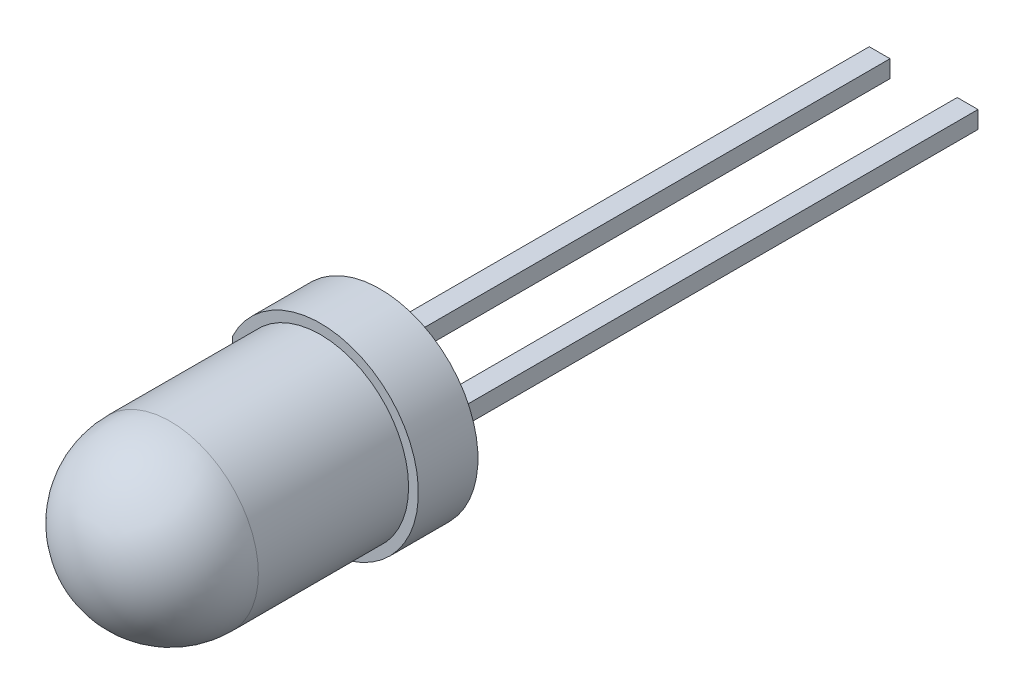
ISO-10303-21;
HEADER;
FILE_DESCRIPTION(('STEP AP214'),'2;1');
FILE_NAME('part.step','',(''),(''),'','','');
FILE_SCHEMA(('AUTOMOTIVE_DESIGN { 1 0 10303 214 1 1 1 1 }'));
ENDSEC;
DATA;
#1=APPLICATION_CONTEXT('core data for automotive mechanical design processes');
#2=APPLICATION_PROTOCOL_DEFINITION('international standard','automotive_design',2000,#1);
#3=PRODUCT_CONTEXT('',#1,'mechanical');
#4=PRODUCT('Part','Part','',(#3));
#5=PRODUCT_RELATED_PRODUCT_CATEGORY('part','',(#4));
#6=PRODUCT_DEFINITION_FORMATION('','',#4);
#7=PRODUCT_DEFINITION_CONTEXT('part definition',#1,'design');
#8=PRODUCT_DEFINITION('design','',#6,#7);
#9=PRODUCT_DEFINITION_SHAPE('','',#8);
#10=(LENGTH_UNIT() NAMED_UNIT(*) SI_UNIT(.MILLI.,.METRE.));
#11=(NAMED_UNIT(*) PLANE_ANGLE_UNIT() SI_UNIT($,.RADIAN.));
#12=(NAMED_UNIT(*) SI_UNIT($,.STERADIAN.) SOLID_ANGLE_UNIT());
#13=UNCERTAINTY_MEASURE_WITH_UNIT(LENGTH_MEASURE(1.E-05),#10,'distance_accuracy_value','');
#14=(GEOMETRIC_REPRESENTATION_CONTEXT(3) GLOBAL_UNCERTAINTY_ASSIGNED_CONTEXT((#13)) GLOBAL_UNIT_ASSIGNED_CONTEXT((#10,
#11,#12)) REPRESENTATION_CONTEXT('',''));
#15=CARTESIAN_POINT('',(0.,0.,0.));
#16=DIRECTION('',(0.,0.,1.));
#17=DIRECTION('',(1.,0.,0.));
#18=AXIS2_PLACEMENT_3D('',#15,#16,#17);
#19=CARTESIAN_POINT('',(-56.58,12.44,15.61));
#20=DIRECTION('',(0.,-1.,0.));
#21=DIRECTION('',(-1.,0.,0.));
#22=AXIS2_PLACEMENT_3D('',#19,#20,#21);
#23=PLANE('',#22);
#24=DIRECTION('',(0.,0.,-1.));
#25=VECTOR('',#24,1.);
#26=CARTESIAN_POINT('',(-56.28,12.44,15.61));
#27=LINE('',#26,#25);
#28=CARTESIAN_POINT('',(-56.28,12.44,31.57));
#29=VERTEX_POINT('',#28);
#30=CARTESIAN_POINT('',(-56.28,12.44,15.8775105573168));
#31=VERTEX_POINT('',#30);
#32=EDGE_CURVE('E11',#29,#31,#27,.T.);
#33=ORIENTED_EDGE('',*,*,#32,.T.);
#34=DIRECTION('',(1.,0.,0.));
#35=VECTOR('',#34,1.);
#36=CARTESIAN_POINT('',(-56.28,12.44,15.8775105573168));
#37=LINE('',#36,#35);
#38=CARTESIAN_POINT('',(-56.88,12.44,15.8775105573168));
#39=VERTEX_POINT('',#38);
#40=EDGE_CURVE('E153',#39,#31,#37,.T.);
#41=ORIENTED_EDGE('',*,*,#40,.F.);
#42=DIRECTION('',(0.,0.,-1.));
#43=VECTOR('',#42,1.);
#44=CARTESIAN_POINT('',(-56.88,12.44,15.61));
#45=LINE('',#44,#43);
#46=CARTESIAN_POINT('',(-56.88,12.44,31.57));
#47=VERTEX_POINT('',#46);
#48=EDGE_CURVE('E170',#47,#39,#45,.T.);
#49=ORIENTED_EDGE('',*,*,#48,.F.);
#50=DIRECTION('',(-1.,0.,0.));
#51=VECTOR('',#50,1.);
#52=CARTESIAN_POINT('',(-57.215,12.44,31.57));
#53=LINE('',#52,#51);
#54=EDGE_CURVE('E60',#29,#47,#53,.T.);
#55=ORIENTED_EDGE('',*,*,#54,.F.);
#56=EDGE_LOOP('',(#33,#41,#49,#55));
#57=FACE_BOUND('',#56,.T.);
#58=ADVANCED_FACE('F41',(#57),#23,.F.);
#59=CARTESIAN_POINT('',(-56.28,12.19,15.61));
#60=DIRECTION('',(-1.,0.,0.));
#61=DIRECTION('',(0.,-1.,0.));
#62=AXIS2_PLACEMENT_3D('',#59,#60,#61);
#63=PLANE('',#62);
#64=DIRECTION('',(0.,0.,-1.));
#65=VECTOR('',#64,1.);
#66=CARTESIAN_POINT('',(-56.28,11.94,15.61));
#67=LINE('',#66,#65);
#68=CARTESIAN_POINT('',(-56.28,11.94,31.57));
#69=VERTEX_POINT('',#68);
#70=CARTESIAN_POINT('',(-56.28,11.94,15.8775105573168));
#71=VERTEX_POINT('',#70);
#72=EDGE_CURVE('E51',#69,#71,#67,.T.);
#73=ORIENTED_EDGE('',*,*,#72,.T.);
#74=DIRECTION('',(0.,-1.,0.));
#75=VECTOR('',#74,1.);
#76=CARTESIAN_POINT('',(-56.28,12.44,15.8775105573168));
#77=LINE('',#76,#75);
#78=EDGE_CURVE('E233',#31,#71,#77,.T.);
#79=ORIENTED_EDGE('',*,*,#78,.F.);
#80=ORIENTED_EDGE('',*,*,#32,.F.);
#81=DIRECTION('',(0.,1.,0.));
#82=VECTOR('',#81,1.);
#83=CARTESIAN_POINT('',(-56.28,12.19,31.57));
#84=LINE('',#83,#82);
#85=EDGE_CURVE('E156',#69,#29,#84,.T.);
#86=ORIENTED_EDGE('',*,*,#85,.F.);
#87=EDGE_LOOP('',(#73,#79,#80,#86));
#88=FACE_BOUND('',#87,.T.);
#89=ADVANCED_FACE('F256',(#88),#63,.F.);
#90=CARTESIAN_POINT('',(-56.58,11.94,15.61));
#91=DIRECTION('',(0.,1.,0.));
#92=DIRECTION('',(0.,0.,-1.));
#93=AXIS2_PLACEMENT_3D('',#90,#91,#92);
#94=PLANE('',#93);
#95=DIRECTION('',(0.,0.,-1.));
#96=VECTOR('',#95,1.);
#97=CARTESIAN_POINT('',(-56.88,11.94,15.61));
#98=LINE('',#97,#96);
#99=CARTESIAN_POINT('',(-56.88,11.94,31.57));
#100=VERTEX_POINT('',#99);
#101=CARTESIAN_POINT('',(-56.88,11.94,15.8775105573168));
#102=VERTEX_POINT('',#101);
#103=EDGE_CURVE('E168',#100,#102,#98,.T.);
#104=ORIENTED_EDGE('',*,*,#103,.T.);
#105=DIRECTION('',(-1.,0.,0.));
#106=VECTOR('',#105,1.);
#107=CARTESIAN_POINT('',(-56.28,11.94,15.8775105573168));
#108=LINE('',#107,#106);
#109=EDGE_CURVE('E236',#71,#102,#108,.T.);
#110=ORIENTED_EDGE('',*,*,#109,.F.);
#111=ORIENTED_EDGE('',*,*,#72,.F.);
#112=DIRECTION('',(1.,0.,0.));
#113=VECTOR('',#112,1.);
#114=CARTESIAN_POINT('',(-57.215,11.94,31.57));
#115=LINE('',#114,#113);
#116=EDGE_CURVE('E158',#100,#69,#115,.T.);
#117=ORIENTED_EDGE('',*,*,#116,.F.);
#118=EDGE_LOOP('',(#104,#110,#111,#117));
#119=FACE_BOUND('',#118,.T.);
#120=ADVANCED_FACE('F245',(#119),#94,.F.);
#121=CARTESIAN_POINT('',(-56.88,12.19,15.61));
#122=DIRECTION('',(1.,0.,0.));
#123=DIRECTION('',(0.,0.,1.));
#124=AXIS2_PLACEMENT_3D('',#121,#122,#123);
#125=PLANE('',#124);
#126=ORIENTED_EDGE('',*,*,#48,.T.);
#127=DIRECTION('',(0.,1.,0.));
#128=VECTOR('',#127,1.);
#129=CARTESIAN_POINT('',(-56.88,12.44,15.8775105573168));
#130=LINE('',#129,#128);
#131=EDGE_CURVE('E238',#102,#39,#130,.T.);
#132=ORIENTED_EDGE('',*,*,#131,.F.);
#133=ORIENTED_EDGE('',*,*,#103,.F.);
#134=DIRECTION('',(0.,-1.,0.));
#135=VECTOR('',#134,1.);
#136=CARTESIAN_POINT('',(-56.88,12.19,31.57));
#137=LINE('',#136,#135);
#138=EDGE_CURVE('E163',#47,#100,#137,.T.);
#139=ORIENTED_EDGE('',*,*,#138,.F.);
#140=EDGE_LOOP('',(#126,#132,#133,#139));
#141=FACE_BOUND('',#140,.T.);
#142=ADVANCED_FACE('F246',(#141),#125,.F.);
#143=CARTESIAN_POINT('',(-59.12,12.44,15.61));
#144=DIRECTION('',(0.,-1.,0.));
#145=DIRECTION('',(-1.,0.,0.));
#146=AXIS2_PLACEMENT_3D('',#143,#144,#145);
#147=PLANE('',#146);
#148=DIRECTION('',(0.,0.,-1.));
#149=VECTOR('',#148,1.);
#150=CARTESIAN_POINT('',(-58.82,12.44,15.61));
#151=LINE('',#150,#149);
#152=CARTESIAN_POINT('',(-58.82,12.44,31.57));
#153=VERTEX_POINT('',#152);
#154=CARTESIAN_POINT('',(-58.82,12.44,15.8775105573168));
#155=VERTEX_POINT('',#154);
#156=EDGE_CURVE('E166',#153,#155,#151,.T.);
#157=ORIENTED_EDGE('',*,*,#156,.T.);
#158=DIRECTION('',(1.,0.,0.));
#159=VECTOR('',#158,1.);
#160=CARTESIAN_POINT('',(-58.82,12.44,15.8775105573168));
#161=LINE('',#160,#159);
#162=CARTESIAN_POINT('',(-59.42,12.44,15.8775105573168));
#163=VERTEX_POINT('',#162);
#164=EDGE_CURVE('E207',#163,#155,#161,.T.);
#165=ORIENTED_EDGE('',*,*,#164,.F.);
#166=DIRECTION('',(0.,0.,-1.));
#167=VECTOR('',#166,1.);
#168=CARTESIAN_POINT('',(-59.42,12.44,15.61));
#169=LINE('',#168,#167);
#170=CARTESIAN_POINT('',(-59.42,12.44,31.57));
#171=VERTEX_POINT('',#170);
#172=EDGE_CURVE('E191',#171,#163,#169,.T.);
#173=ORIENTED_EDGE('',*,*,#172,.F.);
#174=DIRECTION('',(-1.,0.,0.));
#175=VECTOR('',#174,1.);
#176=CARTESIAN_POINT('',(-58.485,12.44,31.57));
#177=LINE('',#176,#175);
#178=EDGE_CURVE('E109',#153,#171,#177,.T.);
#179=ORIENTED_EDGE('',*,*,#178,.F.);
#180=EDGE_LOOP('',(#157,#165,#173,#179));
#181=FACE_BOUND('',#180,.T.);
#182=ADVANCED_FACE('F204',(#181),#147,.F.);
#183=CARTESIAN_POINT('',(-58.82,12.19,15.61));
#184=DIRECTION('',(-1.,0.,0.));
#185=DIRECTION('',(0.,-1.,0.));
#186=AXIS2_PLACEMENT_3D('',#183,#184,#185);
#187=PLANE('',#186);
#188=DIRECTION('',(0.,0.,-1.));
#189=VECTOR('',#188,1.);
#190=CARTESIAN_POINT('',(-58.82,11.94,15.61));
#191=LINE('',#190,#189);
#192=CARTESIAN_POINT('',(-58.82,11.94,31.57));
#193=VERTEX_POINT('',#192);
#194=CARTESIAN_POINT('',(-58.82,11.94,15.8775105573168));
#195=VERTEX_POINT('',#194);
#196=EDGE_CURVE('E165',#193,#195,#191,.T.);
#197=ORIENTED_EDGE('',*,*,#196,.T.);
#198=DIRECTION('',(0.,-1.,0.));
#199=VECTOR('',#198,1.);
#200=CARTESIAN_POINT('',(-58.82,12.44,15.8775105573168));
#201=LINE('',#200,#199);
#202=EDGE_CURVE('E227',#155,#195,#201,.T.);
#203=ORIENTED_EDGE('',*,*,#202,.F.);
#204=ORIENTED_EDGE('',*,*,#156,.F.);
#205=DIRECTION('',(0.,1.,0.));
#206=VECTOR('',#205,1.);
#207=CARTESIAN_POINT('',(-58.82,12.19,31.57));
#208=LINE('',#207,#206);
#209=EDGE_CURVE('E116',#193,#153,#208,.T.);
#210=ORIENTED_EDGE('',*,*,#209,.F.);
#211=EDGE_LOOP('',(#197,#203,#204,#210));
#212=FACE_BOUND('',#211,.T.);
#213=ADVANCED_FACE('F262',(#212),#187,.F.);
#214=CARTESIAN_POINT('',(-59.12,11.94,15.61));
#215=DIRECTION('',(0.,1.,0.));
#216=DIRECTION('',(0.,0.,-1.));
#217=AXIS2_PLACEMENT_3D('',#214,#215,#216);
#218=PLANE('',#217);
#219=DIRECTION('',(0.,0.,-1.));
#220=VECTOR('',#219,1.);
#221=CARTESIAN_POINT('',(-59.42,11.94,15.61));
#222=LINE('',#221,#220);
#223=CARTESIAN_POINT('',(-59.42,11.94,31.57));
#224=VERTEX_POINT('',#223);
#225=CARTESIAN_POINT('',(-59.42,11.94,15.8775105573168));
#226=VERTEX_POINT('',#225);
#227=EDGE_CURVE('E167',#224,#226,#222,.T.);
#228=ORIENTED_EDGE('',*,*,#227,.T.);
#229=DIRECTION('',(-1.,0.,0.));
#230=VECTOR('',#229,1.);
#231=CARTESIAN_POINT('',(-58.82,11.94,15.8775105573168));
#232=LINE('',#231,#230);
#233=EDGE_CURVE('E221',#195,#226,#232,.T.);
#234=ORIENTED_EDGE('',*,*,#233,.F.);
#235=ORIENTED_EDGE('',*,*,#196,.F.);
#236=DIRECTION('',(1.,0.,0.));
#237=VECTOR('',#236,1.);
#238=CARTESIAN_POINT('',(-58.485,11.94,31.57));
#239=LINE('',#238,#237);
#240=EDGE_CURVE('E148',#224,#193,#239,.T.);
#241=ORIENTED_EDGE('',*,*,#240,.F.);
#242=EDGE_LOOP('',(#228,#234,#235,#241));
#243=FACE_BOUND('',#242,.T.);
#244=ADVANCED_FACE('F219',(#243),#218,.F.);
#245=CARTESIAN_POINT('',(-59.42,12.19,15.61));
#246=DIRECTION('',(1.,0.,0.));
#247=DIRECTION('',(0.,0.,1.));
#248=AXIS2_PLACEMENT_3D('',#245,#246,#247);
#249=PLANE('',#248);
#250=ORIENTED_EDGE('',*,*,#172,.T.);
#251=DIRECTION('',(0.,1.,0.));
#252=VECTOR('',#251,1.);
#253=CARTESIAN_POINT('',(-59.42,12.44,15.8775105573168));
#254=LINE('',#253,#252);
#255=EDGE_CURVE('E215',#226,#163,#254,.T.);
#256=ORIENTED_EDGE('',*,*,#255,.F.);
#257=ORIENTED_EDGE('',*,*,#227,.F.);
#258=DIRECTION('',(0.,-1.,0.));
#259=VECTOR('',#258,1.);
#260=CARTESIAN_POINT('',(-59.42,12.19,31.57));
#261=LINE('',#260,#259);
#262=EDGE_CURVE('E195',#171,#224,#261,.T.);
#263=ORIENTED_EDGE('',*,*,#262,.F.);
#264=EDGE_LOOP('',(#250,#256,#257,#263));
#265=FACE_BOUND('',#264,.T.);
#266=ADVANCED_FACE('F213',(#265),#249,.F.);
#267=CARTESIAN_POINT('',(-60.3925,12.19,32.43));
#268=DIRECTION('',(-1.,0.,0.));
#269=DIRECTION('',(0.,-1.,0.));
#270=AXIS2_PLACEMENT_3D('',#267,#268,#269);
#271=PLANE('',#270);
#272=DIRECTION('',(0.,0.,1.));
#273=VECTOR('',#272,1.);
#274=CARTESIAN_POINT('',(-60.3925,13.4213889515502,32.43));
#275=LINE('',#274,#273);
#276=CARTESIAN_POINT('',(-60.3925,13.4213889515502,31.57));
#277=VERTEX_POINT('',#276);
#278=CARTESIAN_POINT('',(-60.3925,13.4213889515502,33.29));
#279=VERTEX_POINT('',#278);
#280=EDGE_CURVE('E136',#277,#279,#275,.T.);
#281=ORIENTED_EDGE('',*,*,#280,.F.);
#282=DIRECTION('',(0.,1.,0.));
#283=VECTOR('',#282,1.);
#284=CARTESIAN_POINT('',(-60.3925,12.19,31.57));
#285=LINE('',#284,#283);
#286=CARTESIAN_POINT('',(-60.3925,10.9586110484498,31.57));
#287=VERTEX_POINT('',#286);
#288=EDGE_CURVE('E126',#287,#277,#285,.T.);
#289=ORIENTED_EDGE('',*,*,#288,.F.);
#290=DIRECTION('',(0.,0.,-1.));
#291=VECTOR('',#290,1.);
#292=CARTESIAN_POINT('',(-60.3925,10.9586110484498,32.43));
#293=LINE('',#292,#291);
#294=CARTESIAN_POINT('',(-60.3925,10.9586110484498,33.29));
#295=VERTEX_POINT('',#294);
#296=EDGE_CURVE('E142',#295,#287,#293,.T.);
#297=ORIENTED_EDGE('',*,*,#296,.F.);
#298=DIRECTION('',(0.,-1.,0.));
#299=VECTOR('',#298,1.);
#300=CARTESIAN_POINT('',(-60.3925,12.19,33.29));
#301=LINE('',#300,#299);
#302=CARTESIAN_POINT('',(-60.3925,12.19,33.29));
#303=VERTEX_POINT('',#302);
#304=EDGE_CURVE('E161',#303,#295,#301,.T.);
#305=ORIENTED_EDGE('',*,*,#304,.F.);
#306=DIRECTION('',(0.,-1.,0.));
#307=VECTOR('',#306,1.);
#308=CARTESIAN_POINT('',(-60.3925,12.19,33.29));
#309=LINE('',#308,#307);
#310=EDGE_CURVE('E45',#279,#303,#309,.T.);
#311=ORIENTED_EDGE('',*,*,#310,.F.);
#312=EDGE_LOOP('',(#281,#289,#297,#305,#311));
#313=FACE_BOUND('',#312,.T.);
#314=ADVANCED_FACE('F137',(#313),#271,.T.);
#315=CARTESIAN_POINT('',(-57.85,12.19,33.29));
#316=DIRECTION('',(0.,0.,1.));
#317=DIRECTION('',(-1.,0.,0.));
#318=AXIS2_PLACEMENT_3D('',#315,#316,#317);
#319=PLANE('',#318);
#320=ORIENTED_EDGE('',*,*,#310,.T.);
#321=CARTESIAN_POINT('',(-57.85,12.19,33.29));
#322=DIRECTION('',(0.,0.,-1.));
#323=DIRECTION('',(-1.,0.,0.));
#324=AXIS2_PLACEMENT_3D('',#321,#322,#323);
#325=CIRCLE('',#324,2.5425);
#326=CARTESIAN_POINT('',(-55.3075,12.19,33.29));
#327=VERTEX_POINT('',#326);
#328=EDGE_CURVE('E154',#303,#327,#325,.T.);
#329=ORIENTED_EDGE('',*,*,#328,.T.);
#330=CARTESIAN_POINT('',(-57.85,12.19,33.29));
#331=DIRECTION('',(0.,0.,-1.));
#332=DIRECTION('',(-1.,0.,0.));
#333=AXIS2_PLACEMENT_3D('',#330,#331,#332);
#334=CIRCLE('',#333,2.5425);
#335=EDGE_CURVE('E91',#327,#303,#334,.T.);
#336=ORIENTED_EDGE('',*,*,#335,.T.);
#337=ORIENTED_EDGE('',*,*,#304,.T.);
#338=CARTESIAN_POINT('',(-57.85,12.19,33.29));
#339=DIRECTION('',(0.,0.,1.));
#340=DIRECTION('',(-1.,0.,0.));
#341=AXIS2_PLACEMENT_3D('',#338,#339,#340);
#342=CIRCLE('',#341,2.825);
#343=EDGE_CURVE('E159',#295,#279,#342,.T.);
#344=ORIENTED_EDGE('',*,*,#343,.T.);
#345=EDGE_LOOP('',(#320,#329,#336,#337,#344));
#346=FACE_BOUND('',#345,.T.);
#347=ADVANCED_FACE('F43',(#346),#319,.T.);
#348=CARTESIAN_POINT('',(-57.85,12.19,37.6275));
#349=DIRECTION('',(0.,0.,1.));
#350=DIRECTION('',(-1.,0.,0.));
#351=AXIS2_PLACEMENT_3D('',#348,#349,#350);
#352=SPHERICAL_SURFACE('',#351,2.5425);
#353=CARTESIAN_POINT('',(-57.85,12.19,37.6275));
#354=DIRECTION('',(0.,0.,1.));
#355=DIRECTION('',(-1.,0.,0.));
#356=AXIS2_PLACEMENT_3D('',#353,#354,#355);
#357=CIRCLE('',#356,2.5425);
#358=CARTESIAN_POINT('',(-55.3075,12.19,37.6275));
#359=VERTEX_POINT('',#358);
#360=EDGE_CURVE('E162',#359,#359,#357,.T.);
#361=ORIENTED_EDGE('',*,*,#360,.T.);
#362=CARTESIAN_POINT('',(-57.85,12.19,37.6275));
#363=DIRECTION('',(0.,1.,0.));
#364=DIRECTION('',(1.,0.,0.));
#365=AXIS2_PLACEMENT_3D('',#362,#363,#364);
#366=CIRCLE('',#365,2.5425);
#367=CARTESIAN_POINT('',(-57.85,12.19,40.17));
#368=VERTEX_POINT('',#367);
#369=EDGE_CURVE('E98',#368,#359,#366,.T.);
#370=ORIENTED_EDGE('',*,*,#369,.F.);
#371=ORIENTED_EDGE('',*,*,#369,.T.);
#372=EDGE_LOOP('',(#361,#370,#371));
#373=FACE_BOUND('',#372,.T.);
#374=ADVANCED_FACE('F285',(#373),#352,.T.);
#375=CARTESIAN_POINT('',(-57.85,12.19,32.43));
#376=DIRECTION('',(0.,0.,1.));
#377=DIRECTION('',(1.,0.,0.));
#378=AXIS2_PLACEMENT_3D('',#375,#376,#377);
#379=CYLINDRICAL_SURFACE('',#378,2.825);
#380=ORIENTED_EDGE('',*,*,#280,.T.);
#381=ORIENTED_EDGE('',*,*,#343,.F.);
#382=ORIENTED_EDGE('',*,*,#296,.T.);
#383=CARTESIAN_POINT('',(-57.85,12.19,31.57));
#384=DIRECTION('',(0.,0.,-1.));
#385=DIRECTION('',(-1.,0.,0.));
#386=AXIS2_PLACEMENT_3D('',#383,#384,#385);
#387=CIRCLE('',#386,2.825);
#388=EDGE_CURVE('E130',#277,#287,#387,.T.);
#389=ORIENTED_EDGE('',*,*,#388,.F.);
#390=EDGE_LOOP('',(#380,#381,#382,#389));
#391=FACE_BOUND('',#390,.T.);
#392=ADVANCED_FACE('F144',(#391),#379,.T.);
#393=CARTESIAN_POINT('',(-57.85,12.19,31.57));
#394=DIRECTION('',(0.,0.,-1.));
#395=DIRECTION('',(0.,1.,0.));
#396=AXIS2_PLACEMENT_3D('',#393,#394,#395);
#397=PLANE('',#396);
#398=ORIENTED_EDGE('',*,*,#388,.T.);
#399=ORIENTED_EDGE('',*,*,#288,.T.);
#400=EDGE_LOOP('',(#398,#399));
#401=FACE_BOUND('',#400,.T.);
#402=ORIENTED_EDGE('',*,*,#54,.T.);
#403=ORIENTED_EDGE('',*,*,#138,.T.);
#404=ORIENTED_EDGE('',*,*,#116,.T.);
#405=ORIENTED_EDGE('',*,*,#85,.T.);
#406=EDGE_LOOP('',(#402,#403,#404,#405));
#407=FACE_BOUND('',#406,.T.);
#408=ORIENTED_EDGE('',*,*,#178,.T.);
#409=ORIENTED_EDGE('',*,*,#262,.T.);
#410=ORIENTED_EDGE('',*,*,#240,.T.);
#411=ORIENTED_EDGE('',*,*,#209,.T.);
#412=EDGE_LOOP('',(#408,#409,#410,#411));
#413=FACE_BOUND('',#412,.T.);
#414=ADVANCED_FACE('F128',(#401,#407,#413),#397,.T.);
#415=CARTESIAN_POINT('',(-57.85,12.19,35.45875));
#416=DIRECTION('',(0.,0.,1.));
#417=DIRECTION('',(-1.,0.,0.));
#418=AXIS2_PLACEMENT_3D('',#415,#416,#417);
#419=CYLINDRICAL_SURFACE('',#418,2.5425);
#420=ORIENTED_EDGE('',*,*,#360,.F.);
#421=DIRECTION('',(0.,0.,-1.));
#422=VECTOR('',#421,1.);
#423=CARTESIAN_POINT('',(-55.3075,12.19,35.45875));
#424=LINE('',#423,#422);
#425=EDGE_CURVE('E150',#359,#327,#424,.T.);
#426=ORIENTED_EDGE('',*,*,#425,.T.);
#427=ORIENTED_EDGE('',*,*,#328,.F.);
#428=ORIENTED_EDGE('',*,*,#335,.F.);
#429=ORIENTED_EDGE('',*,*,#425,.F.);
#430=EDGE_LOOP('',(#420,#426,#427,#428,#429));
#431=FACE_BOUND('',#430,.T.);
#432=ADVANCED_FACE('F284',(#431),#419,.T.);
#433=CARTESIAN_POINT('',(0.,0.,15.8775105573168));
#434=DIRECTION('',(0.,0.,-1.));
#435=DIRECTION('',(-1.,0.,0.));
#436=AXIS2_PLACEMENT_3D('',#433,#434,#435);
#437=PLANE('',#436);
#438=ORIENTED_EDGE('',*,*,#78,.T.);
#439=ORIENTED_EDGE('',*,*,#109,.T.);
#440=ORIENTED_EDGE('',*,*,#131,.T.);
#441=ORIENTED_EDGE('',*,*,#40,.T.);
#442=EDGE_LOOP('',(#438,#439,#440,#441));
#443=FACE_BOUND('',#442,.T.);
#444=ADVANCED_FACE('F251',(#443),#437,.T.);
#445=CARTESIAN_POINT('',(0.,0.,15.8775105573168));
#446=DIRECTION('',(0.,0.,-1.));
#447=DIRECTION('',(-1.,0.,0.));
#448=AXIS2_PLACEMENT_3D('',#445,#446,#447);
#449=PLANE('',#448);
#450=ORIENTED_EDGE('',*,*,#202,.T.);
#451=ORIENTED_EDGE('',*,*,#233,.T.);
#452=ORIENTED_EDGE('',*,*,#255,.T.);
#453=ORIENTED_EDGE('',*,*,#164,.T.);
#454=EDGE_LOOP('',(#450,#451,#452,#453));
#455=FACE_BOUND('',#454,.T.);
#456=ADVANCED_FACE('F225',(#455),#449,.T.);
#457=CLOSED_SHELL('',(#58,#89,#120,#142,#182,#213,#244,#266,#314,#347,#374,#392,#414,#432,#444,#456));
#458=MANIFOLD_SOLID_BREP('B2',#457);
#459=ADVANCED_BREP_SHAPE_REPRESENTATION('',(#18,#458),#14);
#460=SHAPE_DEFINITION_REPRESENTATION(#9,#459);
ENDSEC;
END-ISO-10303-21;
